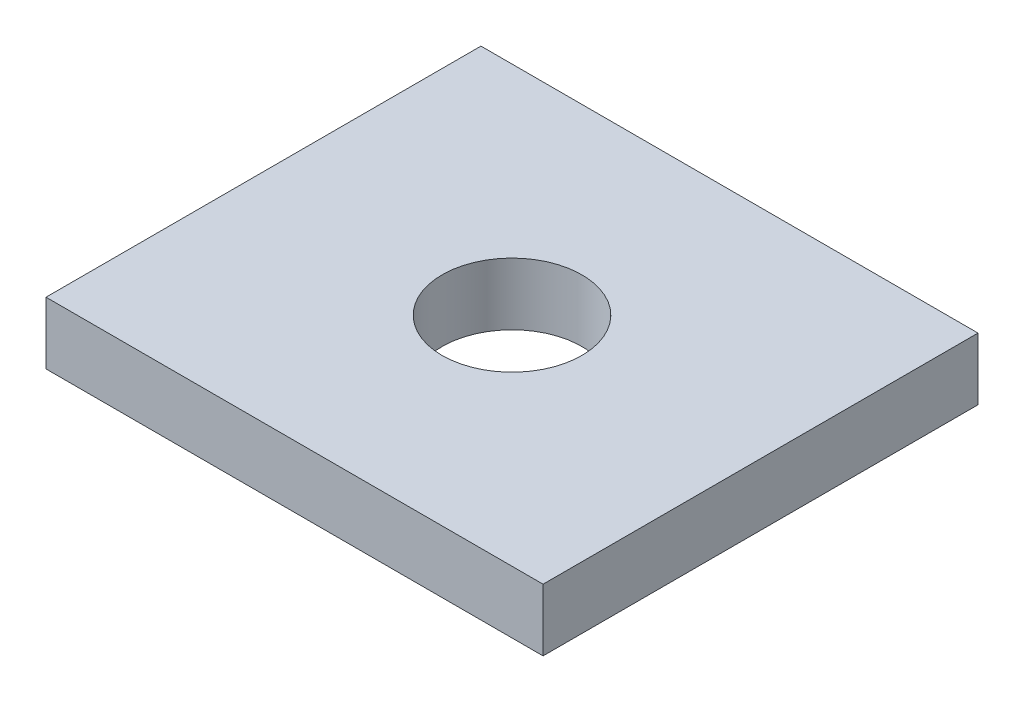
ISO-10303-21;
HEADER;
FILE_DESCRIPTION(('STEP AP214'),'2;1');
FILE_NAME('part.step','',(''),(''),'','','');
FILE_SCHEMA(('AUTOMOTIVE_DESIGN { 1 0 10303 214 1 1 1 1 }'));
ENDSEC;
DATA;
#1=APPLICATION_CONTEXT('core data for automotive mechanical design processes');
#2=APPLICATION_PROTOCOL_DEFINITION('international standard','automotive_design',2000,#1);
#3=PRODUCT_CONTEXT('',#1,'mechanical');
#4=PRODUCT('Part','Part','',(#3));
#5=PRODUCT_RELATED_PRODUCT_CATEGORY('part','',(#4));
#6=PRODUCT_DEFINITION_FORMATION('','',#4);
#7=PRODUCT_DEFINITION_CONTEXT('part definition',#1,'design');
#8=PRODUCT_DEFINITION('design','',#6,#7);
#9=PRODUCT_DEFINITION_SHAPE('','',#8);
#10=(LENGTH_UNIT() NAMED_UNIT(*) SI_UNIT(.MILLI.,.METRE.));
#11=(NAMED_UNIT(*) PLANE_ANGLE_UNIT() SI_UNIT($,.RADIAN.));
#12=(NAMED_UNIT(*) SI_UNIT($,.STERADIAN.) SOLID_ANGLE_UNIT());
#13=UNCERTAINTY_MEASURE_WITH_UNIT(LENGTH_MEASURE(1.E-05),#10,'distance_accuracy_value','');
#14=(GEOMETRIC_REPRESENTATION_CONTEXT(3) GLOBAL_UNCERTAINTY_ASSIGNED_CONTEXT((#13)) GLOBAL_UNIT_ASSIGNED_CONTEXT((#10,
#11,#12)) REPRESENTATION_CONTEXT('',''));
#15=CARTESIAN_POINT('',(0.,0.,0.));
#16=DIRECTION('',(0.,0.,1.));
#17=DIRECTION('',(1.,0.,0.));
#18=AXIS2_PLACEMENT_3D('',#15,#16,#17);
#19=CARTESIAN_POINT('',(-12.7,1.5875,11.1125));
#20=DIRECTION('',(1.,0.,0.));
#21=DIRECTION('',(0.,0.,-1.));
#22=AXIS2_PLACEMENT_3D('',#19,#20,#21);
#23=PLANE('',#22);
#24=DIRECTION('',(0.,0.,1.));
#25=VECTOR('',#24,1.);
#26=CARTESIAN_POINT('',(-12.7,-1.5875,11.1125));
#27=LINE('',#26,#25);
#28=CARTESIAN_POINT('',(-12.7,-1.5875,-11.1125));
#29=VERTEX_POINT('',#28);
#30=CARTESIAN_POINT('',(-12.7,-1.5875,11.1125));
#31=VERTEX_POINT('',#30);
#32=EDGE_CURVE('E100',#29,#31,#27,.T.);
#33=ORIENTED_EDGE('',*,*,#32,.T.);
#34=DIRECTION('',(0.,-1.,0.));
#35=VECTOR('',#34,1.);
#36=CARTESIAN_POINT('',(-12.7,1.5875,11.1125));
#37=LINE('',#36,#35);
#38=CARTESIAN_POINT('',(-12.7,1.5875,11.1125));
#39=VERTEX_POINT('',#38);
#40=EDGE_CURVE('E11',#39,#31,#37,.T.);
#41=ORIENTED_EDGE('',*,*,#40,.F.);
#42=DIRECTION('',(0.,0.,1.));
#43=VECTOR('',#42,1.);
#44=CARTESIAN_POINT('',(-12.7,1.5875,11.1125));
#45=LINE('',#44,#43);
#46=CARTESIAN_POINT('',(-12.7,1.5875,-11.1125));
#47=VERTEX_POINT('',#46);
#48=EDGE_CURVE('E88',#47,#39,#45,.T.);
#49=ORIENTED_EDGE('',*,*,#48,.F.);
#50=DIRECTION('',(0.,-1.,0.));
#51=VECTOR('',#50,1.);
#52=CARTESIAN_POINT('',(-12.7,1.5875,-11.1125));
#53=LINE('',#52,#51);
#54=EDGE_CURVE('E96',#47,#29,#53,.T.);
#55=ORIENTED_EDGE('',*,*,#54,.T.);
#56=EDGE_LOOP('',(#33,#41,#49,#55));
#57=FACE_BOUND('',#56,.T.);
#58=ADVANCED_FACE('F37',(#57),#23,.F.);
#59=CARTESIAN_POINT('',(12.7,1.5875,11.1125));
#60=DIRECTION('',(0.,0.,-1.));
#61=DIRECTION('',(-1.,0.,0.));
#62=AXIS2_PLACEMENT_3D('',#59,#60,#61);
#63=PLANE('',#62);
#64=DIRECTION('',(1.,0.,0.));
#65=VECTOR('',#64,1.);
#66=CARTESIAN_POINT('',(12.7,-1.5875,11.1125));
#67=LINE('',#66,#65);
#68=CARTESIAN_POINT('',(12.7,-1.5875,11.1125));
#69=VERTEX_POINT('',#68);
#70=EDGE_CURVE('E92',#31,#69,#67,.T.);
#71=ORIENTED_EDGE('',*,*,#70,.T.);
#72=DIRECTION('',(0.,-1.,0.));
#73=VECTOR('',#72,1.);
#74=CARTESIAN_POINT('',(12.7,1.5875,11.1125));
#75=LINE('',#74,#73);
#76=CARTESIAN_POINT('',(12.7,1.5875,11.1125));
#77=VERTEX_POINT('',#76);
#78=EDGE_CURVE('E45',#77,#69,#75,.T.);
#79=ORIENTED_EDGE('',*,*,#78,.F.);
#80=DIRECTION('',(1.,0.,0.));
#81=VECTOR('',#80,1.);
#82=CARTESIAN_POINT('',(12.7,1.5875,11.1125));
#83=LINE('',#82,#81);
#84=EDGE_CURVE('E83',#39,#77,#83,.T.);
#85=ORIENTED_EDGE('',*,*,#84,.F.);
#86=ORIENTED_EDGE('',*,*,#40,.T.);
#87=EDGE_LOOP('',(#71,#79,#85,#86));
#88=FACE_BOUND('',#87,.T.);
#89=ADVANCED_FACE('F91',(#88),#63,.F.);
#90=CARTESIAN_POINT('',(12.7,1.5875,-11.1125));
#91=DIRECTION('',(-1.,0.,0.));
#92=DIRECTION('',(0.,0.,1.));
#93=AXIS2_PLACEMENT_3D('',#90,#91,#92);
#94=PLANE('',#93);
#95=DIRECTION('',(0.,0.,-1.));
#96=VECTOR('',#95,1.);
#97=CARTESIAN_POINT('',(12.7,-1.5875,-11.1125));
#98=LINE('',#97,#96);
#99=CARTESIAN_POINT('',(12.7,-1.5875,-11.1125));
#100=VERTEX_POINT('',#99);
#101=EDGE_CURVE('E70',#69,#100,#98,.T.);
#102=ORIENTED_EDGE('',*,*,#101,.T.);
#103=DIRECTION('',(0.,-1.,0.));
#104=VECTOR('',#103,1.);
#105=CARTESIAN_POINT('',(12.7,1.5875,-11.1125));
#106=LINE('',#105,#104);
#107=CARTESIAN_POINT('',(12.7,1.5875,-11.1125));
#108=VERTEX_POINT('',#107);
#109=EDGE_CURVE('E93',#108,#100,#106,.T.);
#110=ORIENTED_EDGE('',*,*,#109,.F.);
#111=DIRECTION('',(0.,0.,-1.));
#112=VECTOR('',#111,1.);
#113=CARTESIAN_POINT('',(12.7,1.5875,-11.1125));
#114=LINE('',#113,#112);
#115=EDGE_CURVE('E86',#77,#108,#114,.T.);
#116=ORIENTED_EDGE('',*,*,#115,.F.);
#117=ORIENTED_EDGE('',*,*,#78,.T.);
#118=EDGE_LOOP('',(#102,#110,#116,#117));
#119=FACE_BOUND('',#118,.T.);
#120=ADVANCED_FACE('F94',(#119),#94,.F.);
#121=CARTESIAN_POINT('',(-12.7,1.5875,-11.1125));
#122=DIRECTION('',(0.,0.,1.));
#123=DIRECTION('',(1.,0.,0.));
#124=AXIS2_PLACEMENT_3D('',#121,#122,#123);
#125=PLANE('',#124);
#126=DIRECTION('',(-1.,0.,0.));
#127=VECTOR('',#126,1.);
#128=CARTESIAN_POINT('',(-12.7,-1.5875,-11.1125));
#129=LINE('',#128,#127);
#130=EDGE_CURVE('E76',#100,#29,#129,.T.);
#131=ORIENTED_EDGE('',*,*,#130,.T.);
#132=ORIENTED_EDGE('',*,*,#54,.F.);
#133=DIRECTION('',(-1.,0.,0.));
#134=VECTOR('',#133,1.);
#135=CARTESIAN_POINT('',(-12.7,1.5875,-11.1125));
#136=LINE('',#135,#134);
#137=EDGE_CURVE('E53',#108,#47,#136,.T.);
#138=ORIENTED_EDGE('',*,*,#137,.F.);
#139=ORIENTED_EDGE('',*,*,#109,.T.);
#140=EDGE_LOOP('',(#131,#132,#138,#139));
#141=FACE_BOUND('',#140,.T.);
#142=ADVANCED_FACE('F108',(#141),#125,.F.);
#143=CARTESIAN_POINT('',(-12.7,1.5875,-11.1125));
#144=DIRECTION('',(0.,-1.,0.));
#145=DIRECTION('',(0.,0.,-1.));
#146=AXIS2_PLACEMENT_3D('',#143,#144,#145);
#147=PLANE('',#146);
#148=CARTESIAN_POINT('',(0.,1.5875,0.));
#149=DIRECTION('',(0.,1.,0.));
#150=DIRECTION('',(0.,0.,1.));
#151=AXIS2_PLACEMENT_3D('',#148,#149,#150);
#152=CIRCLE('',#151,3.571875);
#153=CARTESIAN_POINT('',(0.,1.5875,3.571875));
#154=VERTEX_POINT('',#153);
#155=EDGE_CURVE('E114',#154,#154,#152,.T.);
#156=ORIENTED_EDGE('',*,*,#155,.F.);
#157=EDGE_LOOP('',(#156));
#158=FACE_BOUND('',#157,.T.);
#159=ORIENTED_EDGE('',*,*,#48,.T.);
#160=ORIENTED_EDGE('',*,*,#84,.T.);
#161=ORIENTED_EDGE('',*,*,#115,.T.);
#162=ORIENTED_EDGE('',*,*,#137,.T.);
#163=EDGE_LOOP('',(#159,#160,#161,#162));
#164=FACE_BOUND('',#163,.T.);
#165=ADVANCED_FACE('F84',(#158,#164),#147,.F.);
#166=CARTESIAN_POINT('',(-12.7,-1.5875,-11.1125));
#167=DIRECTION('',(0.,-1.,0.));
#168=DIRECTION('',(0.,0.,-1.));
#169=AXIS2_PLACEMENT_3D('',#166,#167,#168);
#170=PLANE('',#169);
#171=CARTESIAN_POINT('',(0.,-1.5875,0.));
#172=DIRECTION('',(0.,1.,0.));
#173=DIRECTION('',(0.,0.,1.));
#174=AXIS2_PLACEMENT_3D('',#171,#172,#173);
#175=CIRCLE('',#174,3.571875);
#176=CARTESIAN_POINT('',(0.,-1.5875,3.571875));
#177=VERTEX_POINT('',#176);
#178=EDGE_CURVE('E103',#177,#177,#175,.T.);
#179=ORIENTED_EDGE('',*,*,#178,.T.);
#180=EDGE_LOOP('',(#179));
#181=FACE_BOUND('',#180,.T.);
#182=ORIENTED_EDGE('',*,*,#32,.F.);
#183=ORIENTED_EDGE('',*,*,#130,.F.);
#184=ORIENTED_EDGE('',*,*,#101,.F.);
#185=ORIENTED_EDGE('',*,*,#70,.F.);
#186=EDGE_LOOP('',(#182,#183,#184,#185));
#187=FACE_BOUND('',#186,.T.);
#188=ADVANCED_FACE('F111',(#181,#187),#170,.T.);
#189=CARTESIAN_POINT('',(0.,-1.5875,0.));
#190=DIRECTION('',(0.,1.,0.));
#191=DIRECTION('',(0.,0.,1.));
#192=AXIS2_PLACEMENT_3D('',#189,#190,#191);
#193=CYLINDRICAL_SURFACE('',#192,3.571875);
#194=ORIENTED_EDGE('',*,*,#178,.F.);
#195=EDGE_LOOP('',(#194));
#196=FACE_BOUND('',#195,.T.);
#197=ORIENTED_EDGE('',*,*,#155,.T.);
#198=EDGE_LOOP('',(#197));
#199=FACE_BOUND('',#198,.T.);
#200=ADVANCED_FACE('F121',(#196,#199),#193,.F.);
#201=CLOSED_SHELL('',(#58,#89,#120,#142,#165,#188,#200));
#202=MANIFOLD_SOLID_BREP('B2',#201);
#203=ADVANCED_BREP_SHAPE_REPRESENTATION('',(#18,#202),#14);
#204=SHAPE_DEFINITION_REPRESENTATION(#9,#203);
ENDSEC;
END-ISO-10303-21;
